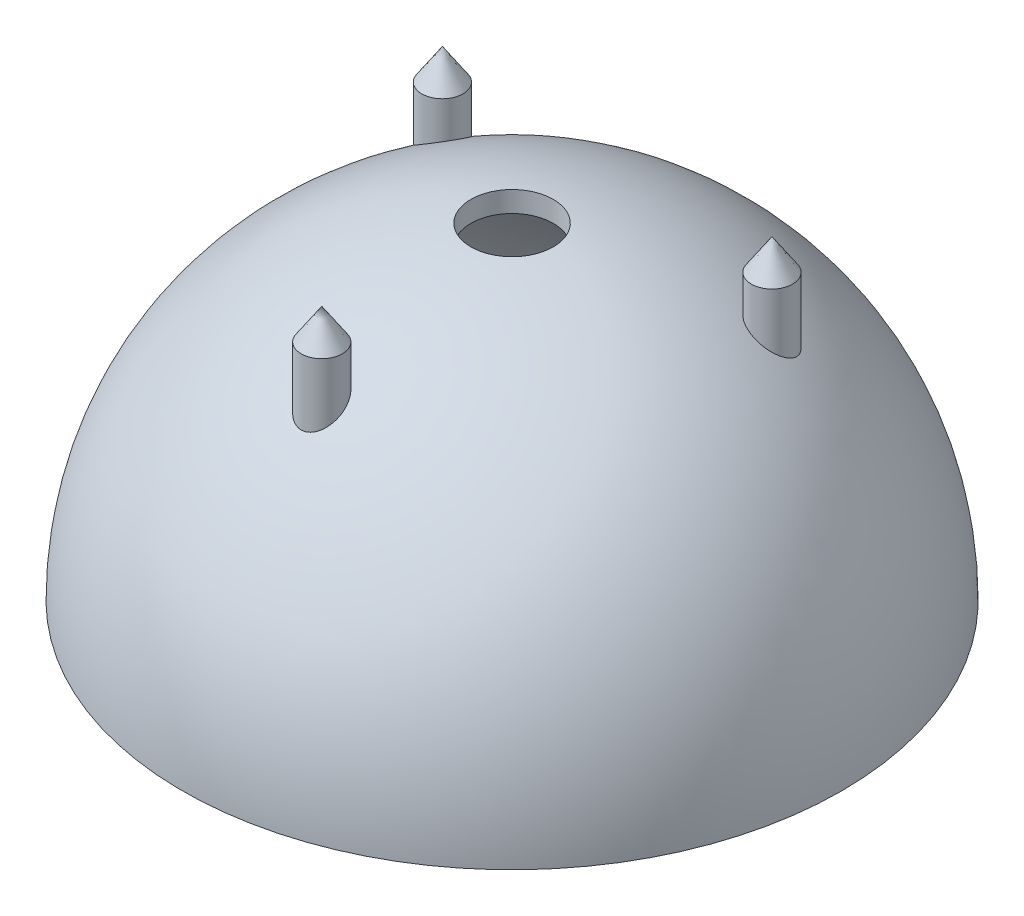
ISO-10303-21;
HEADER;
FILE_DESCRIPTION(('STEP AP214'),'2;1');
FILE_NAME('part.step','',(''),(''),'','','');
FILE_SCHEMA(('AUTOMOTIVE_DESIGN { 1 0 10303 214 1 1 1 1 }'));
ENDSEC;
DATA;
#1=APPLICATION_CONTEXT('core data for automotive mechanical design processes');
#2=APPLICATION_PROTOCOL_DEFINITION('international standard','automotive_design',2000,#1);
#3=PRODUCT_CONTEXT('',#1,'mechanical');
#4=PRODUCT('Part','Part','',(#3));
#5=PRODUCT_RELATED_PRODUCT_CATEGORY('part','',(#4));
#6=PRODUCT_DEFINITION_FORMATION('','',#4);
#7=PRODUCT_DEFINITION_CONTEXT('part definition',#1,'design');
#8=PRODUCT_DEFINITION('design','',#6,#7);
#9=PRODUCT_DEFINITION_SHAPE('','',#8);
#10=(LENGTH_UNIT() NAMED_UNIT(*) SI_UNIT(.MILLI.,.METRE.));
#11=(NAMED_UNIT(*) PLANE_ANGLE_UNIT() SI_UNIT($,.RADIAN.));
#12=(NAMED_UNIT(*) SI_UNIT($,.STERADIAN.) SOLID_ANGLE_UNIT());
#13=UNCERTAINTY_MEASURE_WITH_UNIT(LENGTH_MEASURE(1.E-05),#10,'distance_accuracy_value','');
#14=(GEOMETRIC_REPRESENTATION_CONTEXT(3) GLOBAL_UNCERTAINTY_ASSIGNED_CONTEXT((#13)) GLOBAL_UNIT_ASSIGNED_CONTEXT((#10,
#11,#12)) REPRESENTATION_CONTEXT('',''));
#15=CARTESIAN_POINT('',(0.,0.,0.));
#16=DIRECTION('',(0.,0.,1.));
#17=DIRECTION('',(1.,0.,0.));
#18=AXIS2_PLACEMENT_3D('',#15,#16,#17);
#19=CARTESIAN_POINT('',(0.,0.,0.));
#20=DIRECTION('',(0.,-1.,0.));
#21=DIRECTION('',(1.,0.,0.));
#22=AXIS2_PLACEMENT_3D('',#19,#20,#21);
#23=SPHERICAL_SURFACE('',#22,40.64);
#24=CARTESIAN_POINT('',(0.,40.3212499806244,0.));
#25=DIRECTION('',(0.,-1.,0.));
#26=DIRECTION('',(1.,0.,0.));
#27=AXIS2_PLACEMENT_3D('',#24,#25,#26);
#28=CIRCLE('',#27,5.08);
#29=CARTESIAN_POINT('',(5.08,40.3212499806244,0.));
#30=VERTEX_POINT('',#29);
#31=EDGE_CURVE('E69',#30,#30,#28,.F.);
#32=ORIENTED_EDGE('',*,*,#31,.F.);
#33=EDGE_LOOP('',(#32));
#34=FACE_BOUND('',#33,.T.);
#35=CARTESIAN_POINT('',(-22.2982098182069,31.2545188739904,-13.3249573679844));
#36=CARTESIAN_POINT('',(-22.2166012457678,31.2695458617428,-13.4262745974165));
#37=CARTESIAN_POINT('',(-22.127673318477,31.2919215596522,-13.5206676094944));
#38=CARTESIAN_POINT('',(-21.9389228517461,31.3497669127278,-13.6931591590558));
#39=CARTESIAN_POINT('',(-21.8390874676858,31.3852521252954,-13.7712381632243));
#40=CARTESIAN_POINT('',(-21.6329398386912,31.4668845457837,-13.9096245134743));
#41=CARTESIAN_POINT('',(-21.5266750100413,31.512959381789,-13.9700464385361));
#42=CARTESIAN_POINT('',(-21.3101404115076,31.6137577110789,-14.0739053807636));
#43=CARTESIAN_POINT('',(-21.199870417587,31.6684816887455,-14.1173414461884));
#44=CARTESIAN_POINT('',(-20.9643759746233,31.7916549726144,-14.1921273463113));
#45=CARTESIAN_POINT('',(-20.838946176646,31.8609633588953,-14.2213988181075));
#46=CARTESIAN_POINT('',(-20.5886859221388,32.0057775013161,-14.2606852106117));
#47=CARTESIAN_POINT('',(-20.4638558530688,32.0812868092825,-14.2706890136385));
#48=CARTESIAN_POINT('',(-20.1917084273484,32.2524520541435,-14.2728637436655));
#49=CARTESIAN_POINT('',(-20.0449706368063,32.3490859582497,-14.2610020680997));
#50=CARTESIAN_POINT('',(-19.7580867110606,32.5460668455412,-14.2130943776959));
#51=CARTESIAN_POINT('',(-19.6179449514471,32.6464162167453,-14.1770325446563));
#52=CARTESIAN_POINT('',(-19.3253325329804,32.8646051657813,-14.0748057848305));
#53=CARTESIAN_POINT('',(-19.1743914125616,32.9827124004447,-14.0047971585863));
#54=CARTESIAN_POINT('',(-18.8882830825884,33.2180497720019,-13.8363647829003));
#55=CARTESIAN_POINT('',(-18.7531298967147,33.3352790438455,-13.7379160369452));
#56=CARTESIAN_POINT('',(-18.4964275996313,33.5716290224674,-13.5086365254965));
#57=CARTESIAN_POINT('',(-18.3759223867804,33.6905418091766,-13.3764115196552));
#58=CARTESIAN_POINT('',(-18.1628578013286,33.9198002997966,-13.0848352906519));
#59=CARTESIAN_POINT('',(-18.0702530334512,34.0301597007144,-12.9255287982944));
#60=CARTESIAN_POINT('',(-17.9402726139138,34.2090793391457,-12.630097151312));
#61=CARTESIAN_POINT('',(-17.8947246639573,34.2808393910671,-12.4994692480449));
#62=CARTESIAN_POINT('',(-17.8249821242408,34.4148833538797,-12.2278157557187));
#63=CARTESIAN_POINT('',(-17.800778345851,34.4771713329155,-12.0867946692669));
#64=CARTESIAN_POINT('',(-17.7826860636904,34.5615979833302,-11.8696166717825));
#65=CARTESIAN_POINT('',(-17.7797219290848,34.588348108892,-11.7959068704067));
#66=CARTESIAN_POINT('',(-17.7803184580464,34.6383489078982,-11.6473511759145));
#67=CARTESIAN_POINT('',(-17.7838754724976,34.6616015306034,-11.572505941407));
#68=CARTESIAN_POINT('',(-17.7977863452171,34.7042333324794,-11.4223781861501));
#69=CARTESIAN_POINT('',(-17.8081363902016,34.7236146768445,-11.3470959342072));
#70=CARTESIAN_POINT('',(-17.8357813435379,34.758173749142,-11.1968745616142));
#71=CARTESIAN_POINT('',(-17.8530747856711,34.7733523634109,-11.1219353718974));
#72=CARTESIAN_POINT('',(-17.9093503239919,34.8083077376684,-10.9208169026363));
#73=CARTESIAN_POINT('',(-17.9550324542273,34.823812306253,-10.7956620662897));
#74=CARTESIAN_POINT('',(-18.0659203681405,34.8407110800005,-10.5534254887451));
#75=CARTESIAN_POINT('',(-18.1311123350028,34.8421152467936,-10.4363381061528));
#76=CARTESIAN_POINT('',(-18.2711451787583,34.8313609785896,-10.2257271919454));
#77=CARTESIAN_POINT('',(-18.3443211121818,34.8205727643956,-10.1310183610745));
#78=CARTESIAN_POINT('',(-18.5021286347536,34.7881647604682,-9.9538316830609));
#79=CARTESIAN_POINT('',(-18.5867599145852,34.7665452631583,-9.87135350579242));
#80=CARTESIAN_POINT('',(-18.7661698372273,34.7130637652243,-9.7189750259335));
#81=CARTESIAN_POINT('',(-18.8610896101473,34.6810428566321,-9.64929798040337));
#82=CARTESIAN_POINT('',(-19.0571084108042,34.6081957387431,-9.52490536001552));
#83=CARTESIAN_POINT('',(-19.15820949639,34.567366585489,-9.4701948012684));
#84=CARTESIAN_POINT('',(-19.3754216270025,34.473369347503,-9.37057569777926));
#85=CARTESIAN_POINT('',(-19.4919572942434,34.4193365675015,-9.32741683756868));
#86=CARTESIAN_POINT('',(-19.7266025714442,34.3039301850127,-9.25901824161355));
#87=CARTESIAN_POINT('',(-19.8447129789015,34.2425527269363,-9.23378796612269));
#88=CARTESIAN_POINT('',(-20.0995930078957,34.1034569634244,-9.19755133371206));
#89=CARTESIAN_POINT('',(-20.236231412547,34.0247123496937,-9.18957262904935));
#90=CARTESIAN_POINT('',(-20.5056302810566,33.8615744212935,-9.19496365112894));
#91=CARTESIAN_POINT('',(-20.6383883263359,33.7771776872082,-9.20834641495811));
#92=CARTESIAN_POINT('',(-20.9203733780623,33.5895028427098,-9.25888998468914));
#93=CARTESIAN_POINT('',(-21.0684494007203,33.4854935810232,-9.2997811920007));
#94=CARTESIAN_POINT('',(-21.3532158457074,33.2746658847283,-9.40641633396047));
#95=CARTESIAN_POINT('',(-21.4898999088041,33.1678459243229,-9.47217403770654));
#96=CARTESIAN_POINT('',(-21.7656079387693,32.9401263529093,-9.63635754143632));
#97=CARTESIAN_POINT('',(-21.9027512441606,32.8191507779267,-9.73785830258389));
#98=CARTESIAN_POINT('',(-22.1554253013252,32.5796845581102,-9.9676692590701));
#99=CARTESIAN_POINT('',(-22.2709340382607,32.4611965522313,-10.0960064846177));
#100=CARTESIAN_POINT('',(-22.4773421122363,32.2287234795851,-10.3794529610224));
#101=CARTESIAN_POINT('',(-22.5678187350112,32.1148406151245,-10.5349572243142));
#102=CARTESIAN_POINT('',(-22.7156147164397,31.8988484351389,-10.8682357646694));
#103=CARTESIAN_POINT('',(-22.7730187910754,31.7967095797605,-11.0459517105617));
#104=CARTESIAN_POINT('',(-22.8350839445357,31.6424720480943,-11.355268166841));
#105=CARTESIAN_POINT('',(-22.8510319777277,31.5851532419863,-11.4820568852356));
#106=CARTESIAN_POINT('',(-22.863271694331,31.4809439767552,-11.740953719833));
#107=CARTESIAN_POINT('',(-22.8595750970692,31.4340473175239,-11.8730586179052));
#108=CARTESIAN_POINT('',(-22.8378881346458,31.3733862590042,-12.0729486925865));
#109=CARTESIAN_POINT('',(-22.8278797587232,31.3547128488984,-12.1402001098426));
#110=CARTESIAN_POINT('',(-22.8022673894332,31.3210279290179,-12.2745411173449));
#111=CARTESIAN_POINT('',(-22.7866664293581,31.3060144415848,-12.3416307755061));
#112=CARTESIAN_POINT('',(-22.7498192771342,31.2799539852932,-12.474964993753));
#113=CARTESIAN_POINT('',(-22.7285782153942,31.2689034329938,-12.5412102648133));
#114=CARTESIAN_POINT('',(-22.6805180495428,31.2509854357396,-12.6721963325694));
#115=CARTESIAN_POINT('',(-22.6537005911997,31.2441167589272,-12.7369375668999));
#116=CARTESIAN_POINT('',(-22.5807820401097,31.2325229718069,-12.8941089103048));
#117=CARTESIAN_POINT('',(-22.5315328411625,31.2303098204306,-12.9853007632359));
#118=CARTESIAN_POINT('',(-22.4224440985792,31.2353795040626,-13.1607508415409));
#119=CARTESIAN_POINT('',(-22.3626056568167,31.2426613515613,-13.2450097869901));
#120=CARTESIAN_POINT('',(-22.2982098182069,31.2545188739904,-13.3249573679844));
#121=B_SPLINE_CURVE_WITH_KNOTS('',3,(#35,#36,#37,#38,#39,#40,#41,#42,#43,#44,#45,#46,#47,#48,
#49,#50,#51,#52,#53,#54,#55,#56,#57,#58,#59,#60,#61,#62,#63,#64,#65,#66,#67,#68,#69,#70,#71,#72,
#73,#74,#75,#76,#77,#78,#79,#80,#81,#82,#83,#84,#85,#86,#87,#88,#89,#90,#91,#92,#93,#94,#95,#96,
#97,#98,#99,#100,#101,#102,#103,#104,#105,#106,#107,#108,#109,#110,#111,#112,#113,#114,#115,
#116,#117,#118,#119,#120),.UNSPECIFIED.,.T.,.F.,(4,2,2,2,2,2,2,2,2,2,2,2,2,2,2,2,2,2,2,2,2,2,2,
2,2,2,2,2,2,2,2,2,2,2,2,2,2,2,2,2,2,2,4),(0.,0.392448107339091,0.785363446969576,
1.17566941451001,1.56599724829419,2.00320838337738,2.44067171915809,2.96694574686294,
3.49356410404726,4.1030411815336,4.71305557730065,5.35414856342344,5.99419275833664,
6.45997924815949,6.92556511966094,7.16067860516604,7.39566056560648,7.63051073105542,
7.86531132988811,8.26522274058128,8.66485160258618,9.02367484276102,9.3824883959353,
9.74706410182867,10.1117618482363,10.5167342437515,10.9219201699227,11.3938505412353,
11.8660690458322,12.4204090859778,12.9750565262984,13.5996843768019,14.2249444214312,
14.8601952311597,15.4938115147763,15.9124477345151,16.3308342379862,16.542100420673,
16.7532521902546,16.9642125438386,17.1751107245955,17.4848165883388,17.7944902442751),.UNSPECIFIED.);
#122=CARTESIAN_POINT('',(-22.2982098182069,31.2545188739904,-13.3249573679844));
#123=VERTEX_POINT('',#122);
#124=EDGE_CURVE('E79',#123,#123,#121,.T.);
#125=ORIENTED_EDGE('',*,*,#124,.T.);
#126=EDGE_LOOP('',(#125));
#127=FACE_BOUND('',#126,.T.);
#128=CARTESIAN_POINT('',(0.,0.,0.));
#129=DIRECTION('',(0.,-1.,0.));
#130=DIRECTION('',(1.,0.,0.));
#131=AXIS2_PLACEMENT_3D('',#128,#129,#130);
#132=CIRCLE('',#131,40.64);
#133=CARTESIAN_POINT('',(40.64,0.,0.));
#134=VERTEX_POINT('',#133);
#135=EDGE_CURVE('E11',#134,#134,#132,.T.);
#136=ORIENTED_EDGE('',*,*,#135,.F.);
#137=EDGE_LOOP('',(#136));
#138=FACE_BOUND('',#137,.T.);
#139=CARTESIAN_POINT('',(-2.19143357183619,33.9836145590053,22.1792957502932));
#140=CARTESIAN_POINT('',(-2.12097203346252,34.0666262619641,22.0590639121556));
#141=CARTESIAN_POINT('',(-2.03959737061174,34.1465379956443,21.9428797331313));
#142=CARTESIAN_POINT('',(-1.85486722781385,34.2977605643692,21.7223185387392));
#143=CARTESIAN_POINT('',(-1.75147181898714,34.3690554017915,21.6179635063129));
#144=CARTESIAN_POINT('',(-1.58034329011705,34.4674256837304,21.473598493967));
#145=CARTESIAN_POINT('',(-1.52031394727662,34.4989119521314,21.427320250067));
#146=CARTESIAN_POINT('',(-1.39522546377343,34.558481608132,21.3396579529933));
#147=CARTESIAN_POINT('',(-1.33016920338936,34.5865669210428,21.2982711310637));
#148=CARTESIAN_POINT('',(-1.19545908515579,34.6388914739324,21.221083425456));
#149=CARTESIAN_POINT('',(-1.12581015894901,34.6631347472709,21.1852766844954));
#150=CARTESIAN_POINT('',(-0.982380927265006,34.7073896009666,21.1198563610229));
#151=CARTESIAN_POINT('',(-0.90860159735774,34.727402175294,21.0902413238362));
#152=CARTESIAN_POINT('',(-0.768723606685006,34.760199494544,21.0416745934306));
#153=CARTESIAN_POINT('',(-0.703093497895441,34.7736145949826,21.0217948795896));
#154=CARTESIAN_POINT('',(-0.569850643051696,34.7968773558332,20.987307264352));
#155=CARTESIAN_POINT('',(-0.502238249941412,34.8067256471926,20.97269843057));
#156=CARTESIAN_POINT('',(-0.36565730417957,34.8226848307777,20.9490185405032));
#157=CARTESIAN_POINT('',(-0.29668970892742,34.8287982700297,20.9399437102473));
#158=CARTESIAN_POINT('',(-0.158035210689288,34.8371944759771,20.9274789470157));
#159=CARTESIAN_POINT('',(-0.0883483823661354,34.8394776363443,20.9240884298125));
#160=CARTESIAN_POINT('',(0.102825427241645,34.8404108726505,20.9227032109966));
#161=CARTESIAN_POINT('',(0.224448024541184,34.8351172950819,20.9305653555802));
#162=CARTESIAN_POINT('',(0.464192437515868,34.8130231585362,20.963356706346));
#163=CARTESIAN_POINT('',(0.58231476926017,34.7962243047593,20.9882833833887));
#164=CARTESIAN_POINT('',(0.810628394990951,34.7522528541042,21.0534510765999));
#165=CARTESIAN_POINT('',(0.92089687738934,34.7252051101863,21.0935077596306));
#166=CARTESIAN_POINT('',(1.13268100791715,34.661906355518,21.1871022211027));
#167=CARTESIAN_POINT('',(1.23419437515287,34.6256529561429,21.2406434984111));
#168=CARTESIAN_POINT('',(1.43570095205327,34.5415838174545,21.3645620000343));
#169=CARTESIAN_POINT('',(1.53470361914713,34.49301326615,21.4360319958141));
#170=CARTESIAN_POINT('',(1.71918566812767,34.3881904086175,21.5898948953871));
#171=CARTESIAN_POINT('',(1.80465831010624,34.3319342997036,21.6722932057351));
#172=CARTESIAN_POINT('',(1.97373837178521,34.2040533714641,21.8590854004939));
#173=CARTESIAN_POINT('',(2.05498665870358,34.1313991798063,21.9649068857133));
#174=CARTESIAN_POINT('',(2.1985118484946,33.9799765711247,22.1846870400423));
#175=CARTESIAN_POINT('',(2.26077730740104,33.9012045016432,22.2986505667604));
#176=CARTESIAN_POINT('',(2.37584137261103,33.7249901673487,22.5526444747552));
#177=CARTESIAN_POINT('',(2.42503306868324,33.6267054665854,22.6937271000064));
#178=CARTESIAN_POINT('',(2.49789074142394,33.4264853099863,22.9798191592055));
#179=CARTESIAN_POINT('',(2.52154267845806,33.3245478779595,23.1248307080987));
#180=CARTESIAN_POINT('',(2.54532440703874,33.1043831747941,23.4365590972603));
#181=CARTESIAN_POINT('',(2.54159919307721,32.9859142433084,23.6034094318217));
#182=CARTESIAN_POINT('',(2.50159145442364,32.7498771916137,23.934053191834));
#183=CARTESIAN_POINT('',(2.46527629626663,32.6323100934777,24.0978433852037));
#184=CARTESIAN_POINT('',(2.3574147957813,32.3959017930792,24.4254685802526));
#185=CARTESIAN_POINT('',(2.28427323191655,32.2772664779597,24.588934361512));
#186=CARTESIAN_POINT('',(2.10160081465381,32.049319888272,24.9013959652679));
#187=CARTESIAN_POINT('',(1.99213459002579,31.9399924841127,25.0504168838998));
#188=CARTESIAN_POINT('',(1.77584052940057,31.7676670337514,25.2842534773529));
#189=CARTESIAN_POINT('',(1.67834159876801,31.7006930514071,25.3748096162722));
#190=CARTESIAN_POINT('',(1.46637090576244,31.5768106302565,25.5418547608032));
#191=CARTESIAN_POINT('',(1.3519233168196,31.5198881047567,25.6183634593943));
#192=CARTESIAN_POINT('',(1.12636443220597,31.4268233619948,25.7431835528664));
#193=CARTESIAN_POINT('',(1.0174163485655,31.3888348361031,25.794017318862));
#194=CARTESIAN_POINT('',(0.790433055299244,31.3241653869029,25.8804413972004));
#195=CARTESIAN_POINT('',(0.672401746534952,31.2974796411989,25.9160382105448));
#196=CARTESIAN_POINT('',(0.429650453518601,31.2569901408799,25.9700118570047));
#197=CARTESIAN_POINT('',(0.304900510675837,31.2432501915455,25.9883034003278));
#198=CARTESIAN_POINT('',(0.0533232985407895,31.2298970749068,26.0060803957542));
#199=CARTESIAN_POINT('',(-0.0735032705307952,31.2302792399547,26.0055720616019));
#200=CARTESIAN_POINT('',(-0.313932200224186,31.2444743269744,25.9866732900126));
#201=CARTESIAN_POINT('',(-0.427731370716068,31.2571255241103,25.9698296034004));
#202=CARTESIAN_POINT('',(-0.650327408865905,31.2933897689631,25.9214916929021));
#203=CARTESIAN_POINT('',(-0.759123912962141,31.3170036119955,25.8899964060749));
#204=CARTESIAN_POINT('',(-0.972339951759252,31.3747494174789,25.8128521243639));
#205=CARTESIAN_POINT('',(-1.07654244588081,31.4091653548129,25.7668207647213));
#206=CARTESIAN_POINT('',(-1.27537518896696,31.4866468038404,25.6629730941069));
#207=CARTESIAN_POINT('',(-1.37000172376895,31.5297156524919,25.6051522364375));
#208=CARTESIAN_POINT('',(-1.56117801446696,31.6294359444673,25.4709520403477));
#209=CARTESIAN_POINT('',(-1.65614307661382,31.6871447559792,25.3931078743794));
#210=CARTESIAN_POINT('',(-1.83164251994561,31.8096135744251,25.2273962044997));
#211=CARTESIAN_POINT('',(-1.91216782878724,31.8743779735231,25.1395224554455));
#212=CARTESIAN_POINT('',(-2.07281987348059,32.0222717013497,24.9381883088246));
#213=CARTESIAN_POINT('',(-2.14983571964259,32.1065257297933,24.823072102517));
#214=CARTESIAN_POINT('',(-2.28311432180744,32.2800728582284,24.5849563568085));
#215=CARTESIAN_POINT('',(-2.33936652832683,32.3693684932431,24.4619528472141));
#216=CARTESIAN_POINT('',(-2.43982611473259,32.5678398262234,24.1873798927296));
#217=CARTESIAN_POINT('',(-2.47988331793315,32.6776385328738,24.0347338192907));
#218=CARTESIAN_POINT('',(-2.53130694113067,32.8988680495424,23.7255860807764));
#219=CARTESIAN_POINT('',(-2.5426320434557,33.01030097845,23.5690791896781));
#220=CARTESIAN_POINT('',(-2.53600223315481,33.2441753321685,23.2389401377973));
#221=CARTESIAN_POINT('',(-2.5147490695638,33.366504308184,23.0652860040231));
#222=CARTESIAN_POINT('',(-2.43604211979112,33.6061317230789,22.7232943504104));
#223=CARTESIAN_POINT('',(-2.37870586351683,33.7234451786952,22.5549414257586));
#224=CARTESIAN_POINT('',(-2.26947777462672,33.8863046107809,22.3200880756681));
#225=CARTESIAN_POINT('',(-2.23229027361883,33.9354807193172,22.2490114628499));
#226=CARTESIAN_POINT('',(-2.19143357183619,33.9836145590053,22.1792957502932));
#227=B_SPLINE_CURVE_WITH_KNOTS('',3,(#139,#140,#141,#142,#143,#144,#145,#146,#147,#148,#149,
#150,#151,#152,#153,#154,#155,#156,#157,#158,#159,#160,#161,#162,#163,#164,#165,#166,#167,#168,
#169,#170,#171,#172,#173,#174,#175,#176,#177,#178,#179,#180,#181,#182,#183,#184,#185,#186,#187,
#188,#189,#190,#191,#192,#193,#194,#195,#196,#197,#198,#199,#200,#201,#202,#203,#204,#205,#206,
#207,#208,#209,#210,#211,#212,#213,#214,#215,#216,#217,#218,#219,#220,#221,#222,#223,#224,#225,
#226),.UNSPECIFIED.,.T.,.F.,(4,2,2,2,2,2,2,2,2,2,2,2,2,2,2,2,2,2,2,2,2,2,2,2,2,2,2,2,2,2,2,2,2,
2,2,2,2,2,2,2,2,2,2,4),(0.,0.486402719580303,0.973695028975115,1.21961590370632,
1.46539690307184,1.71091814835081,1.95638164605165,2.16570404134655,2.37498939064997,
2.58413185556397,2.79325282372482,3.15726977591743,3.52123278872523,3.88089753299494,
4.24065569631132,4.63335951854607,5.02625835258306,5.4802852782132,5.93458537920352,
6.46901600583567,7.00374026862971,7.61506567248907,8.22700390198473,8.86807999401369,
9.50802154610098,9.95327529873028,10.397900007048,10.7745735026967,11.1510861261715,
11.5294448875422,11.9076785947135,12.2532762182137,12.598898917966,12.954499683448,
13.3102378489806,13.7157687101785,14.1215534761305,14.6060978730243,15.0908881169849,
15.6653151508048,16.2405677618941,16.8780186079163,17.5134038187889,17.7954415278546),.UNSPECIFIED.);
#228=CARTESIAN_POINT('',(-2.19143357183619,33.9836145590053,22.1792957502932));
#229=VERTEX_POINT('',#228);
#230=EDGE_CURVE('E104',#229,#229,#227,.T.);
#231=ORIENTED_EDGE('',*,*,#230,.T.);
#232=EDGE_LOOP('',(#231));
#233=FACE_BOUND('',#232,.T.);
#234=CARTESIAN_POINT('',(22.301634587126,31.2538919756559,-13.3206955943126));
#235=CARTESIAN_POINT('',(22.3746226485659,31.2406116681409,-13.2296564968805));
#236=CARTESIAN_POINT('',(22.4418083467609,31.2332266652426,-13.1329427117621));
#237=CARTESIAN_POINT('',(22.5621945185286,31.2307828113277,-12.9309335592057));
#238=CARTESIAN_POINT('',(22.6153789271172,31.2357380518523,-12.8256285140435));
#239=CARTESIAN_POINT('',(22.7062059152102,31.257637863526,-12.6099826278629));
#240=CARTESIAN_POINT('',(22.7438808204485,31.2745572960393,-12.4996527986763));
#241=CARTESIAN_POINT('',(22.8034588063527,31.3193249303462,-12.2770330324566));
#242=CARTESIAN_POINT('',(22.8253607880974,31.3471738934062,-12.1647429594089));
#243=CARTESIAN_POINT('',(22.8542885161988,31.4132904564439,-11.9377914623141));
#244=CARTESIAN_POINT('',(22.8608644755364,31.4518367522659,-11.8231556939153));
#245=CARTESIAN_POINT('',(22.8589521754624,31.537239684797,-11.5971990220332));
#246=CARTESIAN_POINT('',(22.8504582470961,31.5840994428765,-11.4858793820215));
#247=CARTESIAN_POINT('',(22.8173792627645,31.6923369367308,-11.2513141012972));
#248=CARTESIAN_POINT('',(22.7904914280769,31.7548391033619,-11.1289158427892));
#249=CARTESIAN_POINT('',(22.7205750625923,31.8865801691599,-10.8926867306641));
#250=CARTESIAN_POINT('',(22.6775360953502,31.9558234027589,-10.7788614739252));
#251=CARTESIAN_POINT('',(22.5673730733595,32.1134021660846,-10.5394799404527));
#252=CARTESIAN_POINT('',(22.4971716981588,32.2028083151588,-10.41604342403));
#253=CARTESIAN_POINT('',(22.3393529573941,32.3861589427108,-10.1846790253192));
#254=CARTESIAN_POINT('',(22.2517249823075,32.4801061593404,-10.0767606599726));
#255=CARTESIAN_POINT('',(22.0447425276798,32.6872434099618,-9.86010892602683));
#256=CARTESIAN_POINT('',(21.9225188471134,32.8009146113421,-9.75456277347971));
#257=CARTESIAN_POINT('',(21.6607009471836,33.0288886109372,-9.56843803413848));
#258=CARTESIAN_POINT('',(21.5210916670627,33.1431918736369,-9.48788130896988));
#259=CARTESIAN_POINT('',(21.2152137325681,33.3793204387776,-9.34831347818433));
#260=CARTESIAN_POINT('',(21.0476876599922,33.5009590761618,-9.29171635649154));
#261=CARTESIAN_POINT('',(20.7003626280888,33.7379648901805,-9.21411518772586));
#262=CARTESIAN_POINT('',(20.5205747372587,33.853337558293,-9.1930794711402));
#263=CARTESIAN_POINT('',(20.1956109243874,34.0485359083402,-9.19083988545448));
#264=CARTESIAN_POINT('',(20.0517689920583,34.1305118666042,-9.20172574240945));
#265=CARTESIAN_POINT('',(19.7634860474337,34.285478522361,-9.24918549354049));
#266=CARTESIAN_POINT('',(19.6190460581298,34.3584807720222,-9.28572594593946));
#267=CARTESIAN_POINT('',(19.3567816887649,34.4818231881275,-9.37804873064632));
#268=CARTESIAN_POINT('',(19.2383828909584,34.5339208814519,-9.42983845345349));
#269=CARTESIAN_POINT('',(19.0077326539393,34.6276416776614,-9.55308308468244));
#270=CARTESIAN_POINT('',(18.8954794027893,34.6692678810883,-9.62453215894448));
#271=CARTESIAN_POINT('',(18.6804745003099,34.7402120914181,-9.78706692506889));
#272=CARTESIAN_POINT('',(18.5777879195656,34.7694500171978,-9.87827478673851));
#273=CARTESIAN_POINT('',(18.3871991022612,34.8134137129059,-10.0780076734715));
#274=CARTESIAN_POINT('',(18.2992865416071,34.828149652093,-10.1865205015992));
#275=CARTESIAN_POINT('',(18.1511955286709,34.8413200203059,-10.4039142856028));
#276=CARTESIAN_POINT('',(18.0889915283038,34.8414321289357,-10.5113219620064));
#277=CARTESIAN_POINT('',(17.9811326714757,34.8295261753311,-10.7334917415244));
#278=CARTESIAN_POINT('',(17.9354739054618,34.8175109812588,-10.8482520996861));
#279=CARTESIAN_POINT('',(17.8629406404031,34.7826620251996,-11.0772548012176));
#280=CARTESIAN_POINT('',(17.8354452006843,34.7602362321685,-11.1913651155663));
#281=CARTESIAN_POINT('',(17.7965376838627,34.7057734611518,-11.4199969184166));
#282=CARTESIAN_POINT('',(17.7851285998402,34.6737346958896,-11.5345184794632));
#283=CARTESIAN_POINT('',(17.7773685716164,34.5986909347303,-11.769522268006));
#284=CARTESIAN_POINT('',(17.7821603568745,34.5550626879524,-11.8898403627095));
#285=CARTESIAN_POINT('',(17.8078939148573,34.4598097100352,-12.1254427888178));
#286=CARTESIAN_POINT('',(17.8288431176916,34.4081813086955,-12.2407247785537));
#287=CARTESIAN_POINT('',(17.8893185627474,34.2904780506037,-12.4806398099906));
#288=CARTESIAN_POINT('',(17.9310969058258,34.2233938985677,-12.6042070927429));
#289=CARTESIAN_POINT('',(18.0311389208835,34.0827218140557,-12.8404495297489));
#290=CARTESIAN_POINT('',(18.0894122109257,34.0091301043438,-12.9531182775797));
#291=CARTESIAN_POINT('',(18.2316716867334,33.8437500662934,-13.185063973826));
#292=CARTESIAN_POINT('',(18.3183780383517,33.7510383687834,-13.3020154014498));
#293=CARTESIAN_POINT('',(18.5081575939006,33.5612864567307,-13.5176713969117));
#294=CARTESIAN_POINT('',(18.6112399783843,33.4642438363077,-13.6163656620421));
#295=CARTESIAN_POINT('',(18.8481496847554,33.252483724959,-13.8082856455383));
#296=CARTESIAN_POINT('',(18.9842648170649,33.1373686689484,-13.8982619597611));
#297=CARTESIAN_POINT('',(19.2710032626637,32.9067607194715,-14.0507243837059));
#298=CARTESIAN_POINT('',(19.4216401126485,32.7912675723355,-14.1131845357217));
#299=CARTESIAN_POINT('',(19.7455246746348,32.5543302432812,-14.2121515915233));
#300=CARTESIAN_POINT('',(19.9196207970559,32.4330821278854,-14.246383317624));
#301=CARTESIAN_POINT('',(20.2758308657396,32.1977462741683,-14.2776431504786));
#302=CARTESIAN_POINT('',(20.4579347383445,32.0836499539974,-14.2747167388458));
#303=CARTESIAN_POINT('',(20.7760995059997,31.8963375151603,-14.2341789683546));
#304=CARTESIAN_POINT('',(20.9116816454517,31.8202588002795,-14.2058864229985));
#305=CARTESIAN_POINT('',(21.180896325984,31.6776498254455,-14.1255251217137));
#306=CARTESIAN_POINT('',(21.3145306714409,31.6111101470595,-14.0734800334733));
#307=CARTESIAN_POINT('',(21.5534944912554,31.5011018918305,-13.9554371692302));
#308=CARTESIAN_POINT('',(21.6597966277356,31.4556349493596,-13.8932728540764));
#309=CARTESIAN_POINT('',(21.8647825942652,31.3758713500472,-13.7518211059025));
#310=CARTESIAN_POINT('',(21.9634849583075,31.3415468159468,-13.6725772447965));
#311=CARTESIAN_POINT('',(22.1000762342786,31.3008466413357,-13.5446288428775));
#312=CARTESIAN_POINT('',(22.1423674518976,31.289319827685,-13.5021239214322));
#313=CARTESIAN_POINT('',(22.2241740742673,31.2692941384312,-13.4138232415086));
#314=CARTESIAN_POINT('',(22.2636884920608,31.260796335102,-13.3680263245397));
#315=CARTESIAN_POINT('',(22.301634587126,31.2538919756559,-13.3206955943126));
#316=B_SPLINE_CURVE_WITH_KNOTS('',3,(#234,#235,#236,#237,#238,#239,#240,#241,#242,#243,#244,
#245,#246,#247,#248,#249,#250,#251,#252,#253,#254,#255,#256,#257,#258,#259,#260,#261,#262,#263,
#264,#265,#266,#267,#268,#269,#270,#271,#272,#273,#274,#275,#276,#277,#278,#279,#280,#281,#282,
#283,#284,#285,#286,#287,#288,#289,#290,#291,#292,#293,#294,#295,#296,#297,#298,#299,#300,#301,
#302,#303,#304,#305,#306,#307,#308,#309,#310,#311,#312,#313,#314,#315),.UNSPECIFIED.,.T.,.F.,(4,
2,2,2,2,2,2,2,2,2,2,2,2,2,2,2,2,2,2,2,2,2,2,2,2,2,2,2,2,2,2,2,2,2,2,2,2,2,2,2,4),(0.,
0.352079104684647,0.704560439007712,1.05630334726053,1.40807075955018,1.77003848185252,
2.13214239718534,2.55071488612214,2.96955831283262,3.47108221645973,3.97291239376679,
4.56289951701656,5.15340133545975,5.79410559257744,6.43423896388552,6.93006732201632,
7.42525054546057,7.84154932400921,8.25772469365875,8.67655073894195,9.09508288023619,
9.46555224631271,9.83593401523083,10.1928892183877,10.5499108290453,10.9326251412638,
11.315515552542,11.7538909949478,12.1925225787544,12.7083339019964,13.2244354208865,
13.820970281248,14.4180666912248,15.0595619429732,15.7002720793938,16.172577057604,
16.6444124421755,17.0366723271361,17.4279431122804,17.6109224078194,17.7939664141031),.UNSPECIFIED.);
#317=CARTESIAN_POINT('',(22.301634587126,31.2538919756559,-13.3206955943126));
#318=VERTEX_POINT('',#317);
#319=EDGE_CURVE('E72',#318,#318,#316,.T.);
#320=ORIENTED_EDGE('',*,*,#319,.T.);
#321=EDGE_LOOP('',(#320));
#322=FACE_BOUND('',#321,.T.);
#323=ADVANCED_FACE('F32',(#34,#127,#138,#233,#322),#23,.T.);
#324=CARTESIAN_POINT('',(0.,0.,0.));
#325=DIRECTION('',(0.,-1.,0.));
#326=DIRECTION('',(-1.,0.,0.));
#327=AXIS2_PLACEMENT_3D('',#324,#325,#326);
#328=SPHERICAL_SURFACE('',#327,38.1);
#329=CARTESIAN_POINT('',(0.,37.759814618189,0.));
#330=DIRECTION('',(0.,-1.,0.));
#331=DIRECTION('',(1.,0.,0.));
#332=AXIS2_PLACEMENT_3D('',#329,#330,#331);
#333=CIRCLE('',#332,5.08);
#334=CARTESIAN_POINT('',(5.08,37.759814618189,0.));
#335=VERTEX_POINT('',#334);
#336=EDGE_CURVE('E36',#335,#335,#333,.T.);
#337=ORIENTED_EDGE('',*,*,#336,.F.);
#338=EDGE_LOOP('',(#337));
#339=FACE_BOUND('',#338,.T.);
#340=CARTESIAN_POINT('',(0.,0.,0.));
#341=DIRECTION('',(0.,-1.,0.));
#342=DIRECTION('',(1.,0.,0.));
#343=AXIS2_PLACEMENT_3D('',#340,#341,#342);
#344=CIRCLE('',#343,38.1);
#345=CARTESIAN_POINT('',(38.1,0.,0.));
#346=VERTEX_POINT('',#345);
#347=EDGE_CURVE('E41',#346,#346,#344,.T.);
#348=ORIENTED_EDGE('',*,*,#347,.T.);
#349=EDGE_LOOP('',(#348));
#350=FACE_BOUND('',#349,.T.);
#351=ADVANCED_FACE('F34',(#339,#350),#328,.F.);
#352=CARTESIAN_POINT('',(38.1,0.,0.));
#353=DIRECTION('',(0.,-1.,0.));
#354=DIRECTION('',(1.,0.,0.));
#355=AXIS2_PLACEMENT_3D('',#352,#353,#354);
#356=PLANE('',#355);
#357=ORIENTED_EDGE('',*,*,#135,.T.);
#358=EDGE_LOOP('',(#357));
#359=FACE_BOUND('',#358,.T.);
#360=ORIENTED_EDGE('',*,*,#347,.F.);
#361=EDGE_LOOP('',(#360));
#362=FACE_BOUND('',#361,.T.);
#363=ADVANCED_FACE('F102',(#359,#362),#356,.T.);
#364=CARTESIAN_POINT('',(0.,-38.101,23.4635149398664));
#365=DIRECTION('',(0.,1.,0.));
#366=DIRECTION('',(-1.,0.,0.));
#367=AXIS2_PLACEMENT_3D('',#364,#365,#366);
#368=CYLINDRICAL_SURFACE('',#367,2.54);
#369=ORIENTED_EDGE('',*,*,#230,.F.);
#370=EDGE_LOOP('',(#369));
#371=FACE_BOUND('',#370,.T.);
#372=CARTESIAN_POINT('',(0.,39.37,23.4635149398664));
#373=DIRECTION('',(0.,-1.,0.));
#374=DIRECTION('',(0.,0.,-1.));
#375=AXIS2_PLACEMENT_3D('',#372,#373,#374);
#376=CIRCLE('',#375,2.54);
#377=CARTESIAN_POINT('',(0.,39.37,20.9235149398664));
#378=VERTEX_POINT('',#377);
#379=EDGE_CURVE('E64',#378,#378,#376,.T.);
#380=ORIENTED_EDGE('',*,*,#379,.T.);
#381=EDGE_LOOP('',(#380));
#382=FACE_BOUND('',#381,.T.);
#383=ADVANCED_FACE('F98',(#371,#382),#368,.T.);
#384=CARTESIAN_POINT('',(-20.32,-38.101,-11.7317574699332));
#385=DIRECTION('',(0.,1.,0.));
#386=DIRECTION('',(-1.,0.,0.));
#387=AXIS2_PLACEMENT_3D('',#384,#385,#386);
#388=CYLINDRICAL_SURFACE('',#387,2.54);
#389=ORIENTED_EDGE('',*,*,#124,.F.);
#390=EDGE_LOOP('',(#389));
#391=FACE_BOUND('',#390,.T.);
#392=CARTESIAN_POINT('',(-20.32,39.37,-11.7317574699333));
#393=DIRECTION('',(0.,-1.,0.));
#394=DIRECTION('',(0.866025403784436,0.,0.500000000000004));
#395=AXIS2_PLACEMENT_3D('',#392,#393,#394);
#396=CIRCLE('',#395,2.54);
#397=CARTESIAN_POINT('',(-18.1202954743875,39.37,-10.4617574699333));
#398=VERTEX_POINT('',#397);
#399=EDGE_CURVE('E61',#398,#398,#396,.T.);
#400=ORIENTED_EDGE('',*,*,#399,.T.);
#401=EDGE_LOOP('',(#400));
#402=FACE_BOUND('',#401,.T.);
#403=ADVANCED_FACE('F92',(#391,#402),#388,.T.);
#404=CARTESIAN_POINT('',(20.32,-38.101,-11.7317574699332));
#405=DIRECTION('',(0.,1.,0.));
#406=DIRECTION('',(-1.,0.,0.));
#407=AXIS2_PLACEMENT_3D('',#404,#405,#406);
#408=CYLINDRICAL_SURFACE('',#407,2.54);
#409=ORIENTED_EDGE('',*,*,#319,.F.);
#410=EDGE_LOOP('',(#409));
#411=FACE_BOUND('',#410,.T.);
#412=CARTESIAN_POINT('',(20.3200000000001,39.37,-11.731757469933));
#413=DIRECTION('',(0.,-1.,0.));
#414=DIRECTION('',(-0.866025403784443,0.,0.499999999999992));
#415=AXIS2_PLACEMENT_3D('',#412,#413,#414);
#416=CIRCLE('',#415,2.54);
#417=CARTESIAN_POINT('',(18.1202954743876,39.37,-10.461757469933));
#418=VERTEX_POINT('',#417);
#419=EDGE_CURVE('E59',#418,#418,#416,.T.);
#420=ORIENTED_EDGE('',*,*,#419,.T.);
#421=EDGE_LOOP('',(#420));
#422=FACE_BOUND('',#421,.T.);
#423=ADVANCED_FACE('F87',(#411,#422),#408,.T.);
#424=CARTESIAN_POINT('',(0.,40.64,0.));
#425=DIRECTION('',(0.,-1.,0.));
#426=DIRECTION('',(1.,0.,0.));
#427=AXIS2_PLACEMENT_3D('',#424,#425,#426);
#428=CYLINDRICAL_SURFACE('',#427,5.08);
#429=ORIENTED_EDGE('',*,*,#31,.T.);
#430=EDGE_LOOP('',(#429));
#431=FACE_BOUND('',#430,.T.);
#432=ORIENTED_EDGE('',*,*,#336,.T.);
#433=EDGE_LOOP('',(#432));
#434=FACE_BOUND('',#433,.T.);
#435=ADVANCED_FACE('F91',(#431,#434),#428,.F.);
#436=CARTESIAN_POINT('',(0.,39.37,23.4635149398664));
#437=DIRECTION('',(0.,-1.,0.));
#438=DIRECTION('',(0.,0.,-1.));
#439=AXIS2_PLACEMENT_3D('',#436,#437,#438);
#440=CONICAL_SURFACE('',#439,2.54,0.588002603547568);
#441=CARTESIAN_POINT('',(0.,43.18,23.4635149398664));
#442=VERTEX_POINT('',#441);
#443=VERTEX_LOOP('',#442);
#444=FACE_BOUND('',#443,.T.);
#445=ORIENTED_EDGE('',*,*,#379,.F.);
#446=EDGE_LOOP('',(#445));
#447=FACE_BOUND('',#446,.T.);
#448=ADVANCED_FACE('F136',(#444,#447),#440,.T.);
#449=CARTESIAN_POINT('',(-20.32,39.37,-11.7317574699333));
#450=DIRECTION('',(0.,-1.,0.));
#451=DIRECTION('',(0.866025403784436,0.,0.500000000000004));
#452=AXIS2_PLACEMENT_3D('',#449,#450,#451);
#453=CONICAL_SURFACE('',#452,2.54,0.588002603547568);
#454=CARTESIAN_POINT('',(-20.32,43.18,-11.7317574699333));
#455=VERTEX_POINT('',#454);
#456=VERTEX_LOOP('',#455);
#457=FACE_BOUND('',#456,.T.);
#458=ORIENTED_EDGE('',*,*,#399,.F.);
#459=EDGE_LOOP('',(#458));
#460=FACE_BOUND('',#459,.T.);
#461=ADVANCED_FACE('F55',(#457,#460),#453,.T.);
#462=CARTESIAN_POINT('',(20.3200000000001,39.37,-11.731757469933));
#463=DIRECTION('',(0.,-1.,0.));
#464=DIRECTION('',(-0.866025403784443,0.,0.499999999999992));
#465=AXIS2_PLACEMENT_3D('',#462,#463,#464);
#466=CONICAL_SURFACE('',#465,2.54,0.588002603547568);
#467=CARTESIAN_POINT('',(20.3200000000001,43.18,-11.731757469933));
#468=VERTEX_POINT('',#467);
#469=VERTEX_LOOP('',#468);
#470=FACE_BOUND('',#469,.T.);
#471=ORIENTED_EDGE('',*,*,#419,.F.);
#472=EDGE_LOOP('',(#471));
#473=FACE_BOUND('',#472,.T.);
#474=ADVANCED_FACE('F52',(#470,#473),#466,.T.);
#475=CLOSED_SHELL('',(#323,#351,#363,#383,#403,#423,#435,#448,#461,#474));
#476=MANIFOLD_SOLID_BREP('B2',#475);
#477=ADVANCED_BREP_SHAPE_REPRESENTATION('',(#18,#476),#14);
#478=SHAPE_DEFINITION_REPRESENTATION(#9,#477);
ENDSEC;
END-ISO-10303-21;
